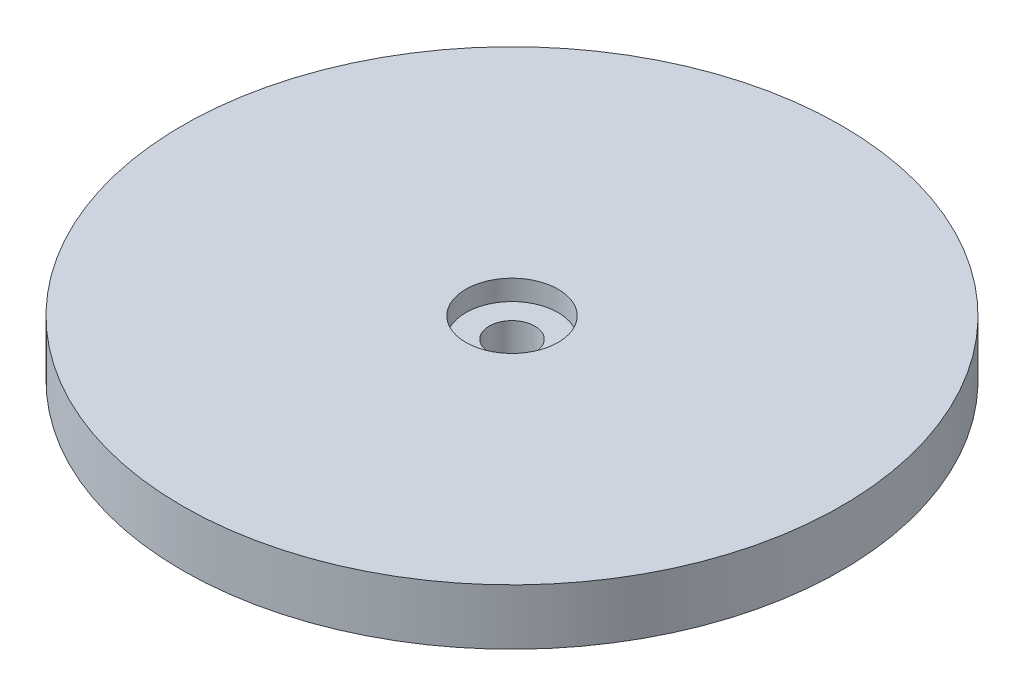
ISO-10303-21;
HEADER;
FILE_DESCRIPTION(('STEP AP214'),'2;1');
FILE_NAME('part.step','',(''),(''),'','','');
FILE_SCHEMA(('AUTOMOTIVE_DESIGN { 1 0 10303 214 1 1 1 1 }'));
ENDSEC;
DATA;
#1=APPLICATION_CONTEXT('core data for automotive mechanical design processes');
#2=APPLICATION_PROTOCOL_DEFINITION('international standard','automotive_design',2000,#1);
#3=PRODUCT_CONTEXT('',#1,'mechanical');
#4=PRODUCT('Part','Part','',(#3));
#5=PRODUCT_RELATED_PRODUCT_CATEGORY('part','',(#4));
#6=PRODUCT_DEFINITION_FORMATION('','',#4);
#7=PRODUCT_DEFINITION_CONTEXT('part definition',#1,'design');
#8=PRODUCT_DEFINITION('design','',#6,#7);
#9=PRODUCT_DEFINITION_SHAPE('','',#8);
#10=(LENGTH_UNIT() NAMED_UNIT(*) SI_UNIT(.MILLI.,.METRE.));
#11=(NAMED_UNIT(*) PLANE_ANGLE_UNIT() SI_UNIT($,.RADIAN.));
#12=(NAMED_UNIT(*) SI_UNIT($,.STERADIAN.) SOLID_ANGLE_UNIT());
#13=UNCERTAINTY_MEASURE_WITH_UNIT(LENGTH_MEASURE(1.E-05),#10,'distance_accuracy_value','');
#14=(GEOMETRIC_REPRESENTATION_CONTEXT(3) GLOBAL_UNCERTAINTY_ASSIGNED_CONTEXT((#13)) GLOBAL_UNIT_ASSIGNED_CONTEXT((#10,
#11,#12)) REPRESENTATION_CONTEXT('',''));
#15=CARTESIAN_POINT('',(0.,0.,0.));
#16=DIRECTION('',(0.,0.,1.));
#17=DIRECTION('',(1.,0.,0.));
#18=AXIS2_PLACEMENT_3D('',#15,#16,#17);
#19=CARTESIAN_POINT('',(0.,11.,0.));
#20=DIRECTION('',(0.,-1.,0.));
#21=DIRECTION('',(0.,0.,-1.));
#22=AXIS2_PLACEMENT_3D('',#19,#20,#21);
#23=CYLINDRICAL_SURFACE('',#22,65.);
#24=CARTESIAN_POINT('',(0.,11.,0.));
#25=DIRECTION('',(0.,1.,0.));
#26=DIRECTION('',(0.,0.,1.));
#27=AXIS2_PLACEMENT_3D('',#24,#25,#26);
#28=CIRCLE('',#27,65.);
#29=CARTESIAN_POINT('',(0.,11.,65.));
#30=VERTEX_POINT('',#29);
#31=EDGE_CURVE('E10',#30,#30,#28,.T.);
#32=ORIENTED_EDGE('',*,*,#31,.F.);
#33=EDGE_LOOP('',(#32));
#34=FACE_BOUND('',#33,.T.);
#35=CARTESIAN_POINT('',(0.,0.,0.));
#36=DIRECTION('',(0.,1.,0.));
#37=DIRECTION('',(0.,0.,1.));
#38=AXIS2_PLACEMENT_3D('',#35,#36,#37);
#39=CIRCLE('',#38,65.);
#40=CARTESIAN_POINT('',(0.,0.,65.));
#41=VERTEX_POINT('',#40);
#42=EDGE_CURVE('E48',#41,#41,#39,.T.);
#43=ORIENTED_EDGE('',*,*,#42,.T.);
#44=EDGE_LOOP('',(#43));
#45=FACE_BOUND('',#44,.T.);
#46=ADVANCED_FACE('F40',(#34,#45),#23,.T.);
#47=CARTESIAN_POINT('',(0.,11.,0.));
#48=DIRECTION('',(0.,1.,0.));
#49=DIRECTION('',(0.,0.,1.));
#50=AXIS2_PLACEMENT_3D('',#47,#48,#49);
#51=PLANE('',#50);
#52=CARTESIAN_POINT('',(0.,11.,0.));
#53=DIRECTION('',(0.,1.,0.));
#54=DIRECTION('',(0.,0.,1.));
#55=AXIS2_PLACEMENT_3D('',#52,#53,#54);
#56=CIRCLE('',#55,9.1);
#57=CARTESIAN_POINT('',(0.,11.,9.1));
#58=VERTEX_POINT('',#57);
#59=EDGE_CURVE('E56',#58,#58,#56,.T.);
#60=ORIENTED_EDGE('',*,*,#59,.F.);
#61=EDGE_LOOP('',(#60));
#62=FACE_BOUND('',#61,.T.);
#63=ORIENTED_EDGE('',*,*,#31,.T.);
#64=EDGE_LOOP('',(#63));
#65=FACE_BOUND('',#64,.T.);
#66=ADVANCED_FACE('F86',(#62,#65),#51,.T.);
#67=CARTESIAN_POINT('',(0.,0.,0.));
#68=DIRECTION('',(0.,1.,0.));
#69=DIRECTION('',(0.,0.,1.));
#70=AXIS2_PLACEMENT_3D('',#67,#68,#69);
#71=PLANE('',#70);
#72=CARTESIAN_POINT('',(0.,0.,0.));
#73=DIRECTION('',(0.,1.,0.));
#74=DIRECTION('',(0.,0.,1.));
#75=AXIS2_PLACEMENT_3D('',#72,#73,#74);
#76=CIRCLE('',#75,4.5);
#77=CARTESIAN_POINT('',(0.,0.,4.5));
#78=VERTEX_POINT('',#77);
#79=EDGE_CURVE('E43',#78,#78,#76,.T.);
#80=ORIENTED_EDGE('',*,*,#79,.T.);
#81=EDGE_LOOP('',(#80));
#82=FACE_BOUND('',#81,.T.);
#83=ORIENTED_EDGE('',*,*,#42,.F.);
#84=EDGE_LOOP('',(#83));
#85=FACE_BOUND('',#84,.T.);
#86=ADVANCED_FACE('F72',(#82,#85),#71,.F.);
#87=CARTESIAN_POINT('',(0.,7.,0.));
#88=DIRECTION('',(0.,1.,0.));
#89=DIRECTION('',(0.,0.,1.));
#90=AXIS2_PLACEMENT_3D('',#87,#88,#89);
#91=CYLINDRICAL_SURFACE('',#90,9.1);
#92=CARTESIAN_POINT('',(0.,7.,0.));
#93=DIRECTION('',(0.,1.,0.));
#94=DIRECTION('',(0.,0.,1.));
#95=AXIS2_PLACEMENT_3D('',#92,#93,#94);
#96=CIRCLE('',#95,9.1);
#97=CARTESIAN_POINT('',(0.,7.,9.1));
#98=VERTEX_POINT('',#97);
#99=EDGE_CURVE('E54',#98,#98,#96,.T.);
#100=ORIENTED_EDGE('',*,*,#99,.F.);
#101=EDGE_LOOP('',(#100));
#102=FACE_BOUND('',#101,.T.);
#103=ORIENTED_EDGE('',*,*,#59,.T.);
#104=EDGE_LOOP('',(#103));
#105=FACE_BOUND('',#104,.T.);
#106=ADVANCED_FACE('F82',(#102,#105),#91,.F.);
#107=CARTESIAN_POINT('',(0.,7.,0.));
#108=DIRECTION('',(0.,1.,0.));
#109=DIRECTION('',(0.,0.,1.));
#110=AXIS2_PLACEMENT_3D('',#107,#108,#109);
#111=PLANE('',#110);
#112=CARTESIAN_POINT('',(0.,7.,0.));
#113=DIRECTION('',(0.,1.,0.));
#114=DIRECTION('',(0.,0.,1.));
#115=AXIS2_PLACEMENT_3D('',#112,#113,#114);
#116=CIRCLE('',#115,4.5);
#117=CARTESIAN_POINT('',(0.,7.,4.5));
#118=VERTEX_POINT('',#117);
#119=EDGE_CURVE('E63',#118,#118,#116,.T.);
#120=ORIENTED_EDGE('',*,*,#119,.F.);
#121=EDGE_LOOP('',(#120));
#122=FACE_BOUND('',#121,.T.);
#123=ORIENTED_EDGE('',*,*,#99,.T.);
#124=EDGE_LOOP('',(#123));
#125=FACE_BOUND('',#124,.T.);
#126=ADVANCED_FACE('F77',(#122,#125),#111,.T.);
#127=CARTESIAN_POINT('',(0.,-13.,0.));
#128=DIRECTION('',(0.,1.,0.));
#129=DIRECTION('',(0.,0.,1.));
#130=AXIS2_PLACEMENT_3D('',#127,#128,#129);
#131=CYLINDRICAL_SURFACE('',#130,4.5);
#132=ORIENTED_EDGE('',*,*,#119,.T.);
#133=EDGE_LOOP('',(#132));
#134=FACE_BOUND('',#133,.T.);
#135=ORIENTED_EDGE('',*,*,#79,.F.);
#136=EDGE_LOOP('',(#135));
#137=FACE_BOUND('',#136,.T.);
#138=ADVANCED_FACE('F75',(#134,#137),#131,.F.);
#139=CLOSED_SHELL('',(#46,#66,#86,#106,#126,#138));
#140=MANIFOLD_SOLID_BREP('B2',#139);
#141=ADVANCED_BREP_SHAPE_REPRESENTATION('',(#18,#140),#14);
#142=SHAPE_DEFINITION_REPRESENTATION(#9,#141);
ENDSEC;
END-ISO-10303-21;
